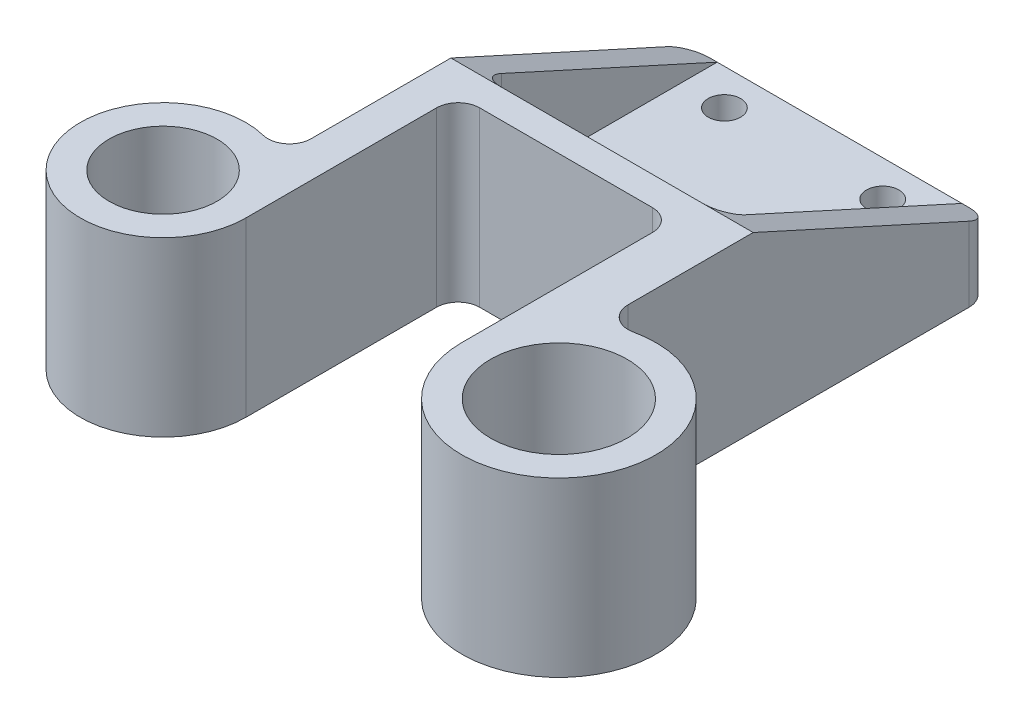
ISO-10303-21;
HEADER;
FILE_DESCRIPTION(('STEP AP214'),'2;1');
FILE_NAME('part.step','',(''),(''),'','','');
FILE_SCHEMA(('AUTOMOTIVE_DESIGN { 1 0 10303 214 1 1 1 1 }'));
ENDSEC;
DATA;
#1=APPLICATION_CONTEXT('core data for automotive mechanical design processes');
#2=APPLICATION_PROTOCOL_DEFINITION('international standard','automotive_design',2000,#1);
#3=PRODUCT_CONTEXT('',#1,'mechanical');
#4=PRODUCT('Part','Part','',(#3));
#5=PRODUCT_RELATED_PRODUCT_CATEGORY('part','',(#4));
#6=PRODUCT_DEFINITION_FORMATION('','',#4);
#7=PRODUCT_DEFINITION_CONTEXT('part definition',#1,'design');
#8=PRODUCT_DEFINITION('design','',#6,#7);
#9=PRODUCT_DEFINITION_SHAPE('','',#8);
#10=(LENGTH_UNIT() NAMED_UNIT(*) SI_UNIT(.MILLI.,.METRE.));
#11=(NAMED_UNIT(*) PLANE_ANGLE_UNIT() SI_UNIT($,.RADIAN.));
#12=(NAMED_UNIT(*) SI_UNIT($,.STERADIAN.) SOLID_ANGLE_UNIT());
#13=UNCERTAINTY_MEASURE_WITH_UNIT(LENGTH_MEASURE(1.E-05),#10,'distance_accuracy_value','');
#14=(GEOMETRIC_REPRESENTATION_CONTEXT(3) GLOBAL_UNCERTAINTY_ASSIGNED_CONTEXT((#13)) GLOBAL_UNIT_ASSIGNED_CONTEXT((#10,
#11,#12)) REPRESENTATION_CONTEXT('',''));
#15=CARTESIAN_POINT('',(0.,0.,0.));
#16=DIRECTION('',(0.,0.,1.));
#17=DIRECTION('',(1.,0.,0.));
#18=AXIS2_PLACEMENT_3D('',#15,#16,#17);
#19=CARTESIAN_POINT('',(11.,24.,-38.5));
#20=DIRECTION('',(0.,-1.,0.));
#21=DIRECTION('',(0.,0.,-1.));
#22=AXIS2_PLACEMENT_3D('',#19,#20,#21);
#23=CYLINDRICAL_SURFACE('',#22,2.25);
#24=CARTESIAN_POINT('',(11.,0.,-38.5));
#25=DIRECTION('',(0.,1.,0.));
#26=DIRECTION('',(0.,0.,1.));
#27=AXIS2_PLACEMENT_3D('',#24,#25,#26);
#28=CIRCLE('',#27,2.25);
#29=CARTESIAN_POINT('',(11.,0.,-36.25));
#30=VERTEX_POINT('',#29);
#31=EDGE_CURVE('E285',#30,#30,#28,.T.);
#32=ORIENTED_EDGE('',*,*,#31,.F.);
#33=EDGE_LOOP('',(#32));
#34=FACE_BOUND('',#33,.T.);
#35=CARTESIAN_POINT('',(11.,9.,-38.5));
#36=DIRECTION('',(0.,1.,0.));
#37=DIRECTION('',(0.,0.,1.));
#38=AXIS2_PLACEMENT_3D('',#35,#36,#37);
#39=CIRCLE('',#38,2.25);
#40=CARTESIAN_POINT('',(11.,9.,-36.25));
#41=VERTEX_POINT('',#40);
#42=EDGE_CURVE('E220',#41,#41,#39,.T.);
#43=ORIENTED_EDGE('',*,*,#42,.T.);
#44=EDGE_LOOP('',(#43));
#45=FACE_BOUND('',#44,.T.);
#46=ADVANCED_FACE('F35',(#34,#45),#23,.F.);
#47=CARTESIAN_POINT('',(-11.,24.,-38.5));
#48=DIRECTION('',(0.,-1.,0.));
#49=DIRECTION('',(0.,0.,-1.));
#50=AXIS2_PLACEMENT_3D('',#47,#48,#49);
#51=CYLINDRICAL_SURFACE('',#50,2.25);
#52=CARTESIAN_POINT('',(-11.,0.,-38.5));
#53=DIRECTION('',(0.,1.,0.));
#54=DIRECTION('',(0.,0.,1.));
#55=AXIS2_PLACEMENT_3D('',#52,#53,#54);
#56=CIRCLE('',#55,2.25);
#57=CARTESIAN_POINT('',(-11.,0.,-36.25));
#58=VERTEX_POINT('',#57);
#59=EDGE_CURVE('E256',#58,#58,#56,.T.);
#60=ORIENTED_EDGE('',*,*,#59,.F.);
#61=EDGE_LOOP('',(#60));
#62=FACE_BOUND('',#61,.T.);
#63=CARTESIAN_POINT('',(-11.,9.,-38.5));
#64=DIRECTION('',(0.,1.,0.));
#65=DIRECTION('',(0.,0.,1.));
#66=AXIS2_PLACEMENT_3D('',#63,#64,#65);
#67=CIRCLE('',#66,2.25);
#68=CARTESIAN_POINT('',(-11.,9.,-36.25));
#69=VERTEX_POINT('',#68);
#70=EDGE_CURVE('E217',#69,#69,#67,.T.);
#71=ORIENTED_EDGE('',*,*,#70,.T.);
#72=EDGE_LOOP('',(#71));
#73=FACE_BOUND('',#72,.T.);
#74=ADVANCED_FACE('F412',(#62,#73),#51,.F.);
#75=CARTESIAN_POINT('',(11.,24.,-61.5));
#76=DIRECTION('',(0.,-1.,0.));
#77=DIRECTION('',(0.,0.,-1.));
#78=AXIS2_PLACEMENT_3D('',#75,#76,#77);
#79=CYLINDRICAL_SURFACE('',#78,2.25);
#80=CARTESIAN_POINT('',(11.,0.,-61.5));
#81=DIRECTION('',(0.,1.,0.));
#82=DIRECTION('',(0.,0.,1.));
#83=AXIS2_PLACEMENT_3D('',#80,#81,#82);
#84=CIRCLE('',#83,2.25);
#85=CARTESIAN_POINT('',(11.,0.,-59.25));
#86=VERTEX_POINT('',#85);
#87=EDGE_CURVE('E253',#86,#86,#84,.T.);
#88=ORIENTED_EDGE('',*,*,#87,.F.);
#89=EDGE_LOOP('',(#88));
#90=FACE_BOUND('',#89,.T.);
#91=CARTESIAN_POINT('',(11.,9.,-61.5));
#92=DIRECTION('',(0.,1.,0.));
#93=DIRECTION('',(0.,0.,1.));
#94=AXIS2_PLACEMENT_3D('',#91,#92,#93);
#95=CIRCLE('',#94,2.25);
#96=CARTESIAN_POINT('',(11.,9.,-59.25));
#97=VERTEX_POINT('',#96);
#98=EDGE_CURVE('E208',#97,#97,#95,.T.);
#99=ORIENTED_EDGE('',*,*,#98,.T.);
#100=EDGE_LOOP('',(#99));
#101=FACE_BOUND('',#100,.T.);
#102=ADVANCED_FACE('F418',(#90,#101),#79,.F.);
#103=CARTESIAN_POINT('',(-11.,24.,-61.5));
#104=DIRECTION('',(0.,-1.,0.));
#105=DIRECTION('',(0.,0.,-1.));
#106=AXIS2_PLACEMENT_3D('',#103,#104,#105);
#107=CYLINDRICAL_SURFACE('',#106,2.25);
#108=CARTESIAN_POINT('',(-11.,0.,-61.5));
#109=DIRECTION('',(0.,1.,0.));
#110=DIRECTION('',(0.,0.,1.));
#111=AXIS2_PLACEMENT_3D('',#108,#109,#110);
#112=CIRCLE('',#111,2.25);
#113=CARTESIAN_POINT('',(-11.,0.,-59.25));
#114=VERTEX_POINT('',#113);
#115=EDGE_CURVE('E223',#114,#114,#112,.T.);
#116=ORIENTED_EDGE('',*,*,#115,.F.);
#117=EDGE_LOOP('',(#116));
#118=FACE_BOUND('',#117,.T.);
#119=CARTESIAN_POINT('',(-11.,9.,-61.5));
#120=DIRECTION('',(0.,1.,0.));
#121=DIRECTION('',(0.,0.,1.));
#122=AXIS2_PLACEMENT_3D('',#119,#120,#121);
#123=CIRCLE('',#122,2.25);
#124=CARTESIAN_POINT('',(-11.,9.,-59.25));
#125=VERTEX_POINT('',#124);
#126=EDGE_CURVE('E205',#125,#125,#123,.T.);
#127=ORIENTED_EDGE('',*,*,#126,.T.);
#128=EDGE_LOOP('',(#127));
#129=FACE_BOUND('',#128,.T.);
#130=ADVANCED_FACE('F453',(#118,#129),#107,.F.);
#131=CARTESIAN_POINT('',(27.5,24.,0.));
#132=DIRECTION('',(0.,-1.,0.));
#133=DIRECTION('',(0.,0.,-1.));
#134=AXIS2_PLACEMENT_3D('',#131,#132,#133);
#135=CYLINDRICAL_SURFACE('',#134,13.5);
#136=CARTESIAN_POINT('',(27.5,0.,0.));
#137=DIRECTION('',(0.,1.,0.));
#138=DIRECTION('',(0.,0.,1.));
#139=AXIS2_PLACEMENT_3D('',#136,#137,#138);
#140=CIRCLE('',#139,13.5);
#141=CARTESIAN_POINT('',(14.,0.,0.));
#142=VERTEX_POINT('',#141);
#143=CARTESIAN_POINT('',(24.6363636363636,0.,-13.1927854063067));
#144=VERTEX_POINT('',#143);
#145=EDGE_CURVE('E262',#142,#144,#140,.T.);
#146=ORIENTED_EDGE('',*,*,#145,.T.);
#147=DIRECTION('',(0.,-1.,0.));
#148=VECTOR('',#147,1.);
#149=CARTESIAN_POINT('',(24.6363636363636,24.,-13.1927854063067));
#150=LINE('',#149,#148);
#151=CARTESIAN_POINT('',(24.6363636363636,24.,-13.1927854063067));
#152=VERTEX_POINT('',#151);
#153=EDGE_CURVE('E327',#144,#152,#150,.F.);
#154=ORIENTED_EDGE('',*,*,#153,.T.);
#155=CARTESIAN_POINT('',(27.5,24.,0.));
#156=DIRECTION('',(0.,1.,0.));
#157=DIRECTION('',(0.,0.,1.));
#158=AXIS2_PLACEMENT_3D('',#155,#156,#157);
#159=CIRCLE('',#158,13.5);
#160=CARTESIAN_POINT('',(14.,24.,0.));
#161=VERTEX_POINT('',#160);
#162=EDGE_CURVE('E227',#161,#152,#159,.T.);
#163=ORIENTED_EDGE('',*,*,#162,.F.);
#164=DIRECTION('',(0.,-1.,0.));
#165=VECTOR('',#164,1.);
#166=CARTESIAN_POINT('',(14.,24.,0.));
#167=LINE('',#166,#165);
#168=EDGE_CURVE('E250',#161,#142,#167,.T.);
#169=ORIENTED_EDGE('',*,*,#168,.T.);
#170=EDGE_LOOP('',(#146,#154,#163,#169));
#171=FACE_BOUND('',#170,.T.);
#172=ADVANCED_FACE('F449',(#171),#135,.T.);
#173=CARTESIAN_POINT('',(21.,24.,0.));
#174=DIRECTION('',(1.,0.,0.));
#175=DIRECTION('',(0.,0.,-1.));
#176=AXIS2_PLACEMENT_3D('',#173,#174,#175);
#177=PLANE('',#176);
#178=DIRECTION('',(0.,0.,1.));
#179=VECTOR('',#178,1.);
#180=CARTESIAN_POINT('',(21.,24.,0.));
#181=LINE('',#180,#179);
#182=CARTESIAN_POINT('',(21.,24.,-33.5));
#183=VERTEX_POINT('',#182);
#184=CARTESIAN_POINT('',(21.,24.,-16.1245154965971));
#185=VERTEX_POINT('',#184);
#186=EDGE_CURVE('E231',#183,#185,#181,.T.);
#187=ORIENTED_EDGE('',*,*,#186,.T.);
#188=DIRECTION('',(0.,-1.,0.));
#189=VECTOR('',#188,1.);
#190=CARTESIAN_POINT('',(21.,24.,-16.1245154965971));
#191=LINE('',#190,#189);
#192=CARTESIAN_POINT('',(21.,0.,-16.1245154965971));
#193=VERTEX_POINT('',#192);
#194=EDGE_CURVE('E324',#185,#193,#191,.T.);
#195=ORIENTED_EDGE('',*,*,#194,.T.);
#196=DIRECTION('',(0.,0.,1.));
#197=VECTOR('',#196,1.);
#198=CARTESIAN_POINT('',(21.,0.,0.));
#199=LINE('',#198,#197);
#200=CARTESIAN_POINT('',(21.,0.,-63.5));
#201=VERTEX_POINT('',#200);
#202=EDGE_CURVE('E265',#201,#193,#199,.T.);
#203=ORIENTED_EDGE('',*,*,#202,.F.);
#204=DIRECTION('',(0.,-1.,0.));
#205=VECTOR('',#204,1.);
#206=CARTESIAN_POINT('',(21.,24.,-63.5));
#207=LINE('',#206,#205);
#208=CARTESIAN_POINT('',(21.,10.3636363636364,-63.5));
#209=VERTEX_POINT('',#208);
#210=EDGE_CURVE('E322',#201,#209,#207,.F.);
#211=ORIENTED_EDGE('',*,*,#210,.T.);
#212=DIRECTION('',(0.,-0.413802944301184,-0.910366477462605));
#213=VECTOR('',#212,1.);
#214=CARTESIAN_POINT('',(21.,36.6198630136986,-5.73630136986302));
#215=LINE('',#214,#213);
#216=EDGE_CURVE('E214',#183,#209,#215,.T.);
#217=ORIENTED_EDGE('',*,*,#216,.F.);
#218=EDGE_LOOP('',(#187,#195,#203,#211,#217));
#219=FACE_BOUND('',#218,.T.);
#220=ADVANCED_FACE('F446',(#219),#177,.T.);
#221=CARTESIAN_POINT('',(0.,24.,-66.5));
#222=DIRECTION('',(0.,0.,-1.));
#223=DIRECTION('',(-1.,0.,0.));
#224=AXIS2_PLACEMENT_3D('',#221,#222,#223);
#225=PLANE('',#224);
#226=DIRECTION('',(1.,0.,0.));
#227=VECTOR('',#226,1.);
#228=CARTESIAN_POINT('',(0.,0.,-66.5));
#229=LINE('',#228,#227);
#230=CARTESIAN_POINT('',(-18.,0.,-66.5));
#231=VERTEX_POINT('',#230);
#232=CARTESIAN_POINT('',(18.,0.,-66.5));
#233=VERTEX_POINT('',#232);
#234=EDGE_CURVE('E268',#231,#233,#229,.T.);
#235=ORIENTED_EDGE('',*,*,#234,.F.);
#236=DIRECTION('',(0.,-1.,0.));
#237=VECTOR('',#236,1.);
#238=CARTESIAN_POINT('',(-18.,24.,-66.5));
#239=LINE('',#238,#237);
#240=CARTESIAN_POINT('',(-18.,9.,-66.5));
#241=VERTEX_POINT('',#240);
#242=EDGE_CURVE('E175',#231,#241,#239,.F.);
#243=ORIENTED_EDGE('',*,*,#242,.T.);
#244=DIRECTION('',(1.,0.,0.));
#245=VECTOR('',#244,1.);
#246=CARTESIAN_POINT('',(-39.,9.,-66.5));
#247=LINE('',#246,#245);
#248=CARTESIAN_POINT('',(-17.,9.,-66.5));
#249=VERTEX_POINT('',#248);
#250=EDGE_CURVE('E167',#241,#249,#247,.T.);
#251=ORIENTED_EDGE('',*,*,#250,.T.);
#252=DIRECTION('',(-1.,0.,0.));
#253=VECTOR('',#252,1.);
#254=CARTESIAN_POINT('',(-17.,9.,-66.5));
#255=LINE('',#254,#253);
#256=CARTESIAN_POINT('',(17.,9.,-66.5));
#257=VERTEX_POINT('',#256);
#258=EDGE_CURVE('E173',#257,#249,#255,.T.);
#259=ORIENTED_EDGE('',*,*,#258,.F.);
#260=CARTESIAN_POINT('',(18.,9.,-66.5));
#261=VERTEX_POINT('',#260);
#262=EDGE_CURVE('E179',#257,#261,#247,.T.);
#263=ORIENTED_EDGE('',*,*,#262,.T.);
#264=DIRECTION('',(0.,-1.,0.));
#265=VECTOR('',#264,1.);
#266=CARTESIAN_POINT('',(18.,24.,-66.5));
#267=LINE('',#266,#265);
#268=EDGE_CURVE('E306',#261,#233,#267,.T.);
#269=ORIENTED_EDGE('',*,*,#268,.T.);
#270=EDGE_LOOP('',(#235,#243,#251,#259,#263,#269));
#271=FACE_BOUND('',#270,.T.);
#272=ADVANCED_FACE('F170',(#271),#225,.T.);
#273=CARTESIAN_POINT('',(-21.,24.,0.));
#274=DIRECTION('',(-1.,0.,0.));
#275=DIRECTION('',(0.,0.,1.));
#276=AXIS2_PLACEMENT_3D('',#273,#274,#275);
#277=PLANE('',#276);
#278=DIRECTION('',(0.,0.,-1.));
#279=VECTOR('',#278,1.);
#280=CARTESIAN_POINT('',(-21.,0.,0.));
#281=LINE('',#280,#279);
#282=CARTESIAN_POINT('',(-21.,0.,-14.0712472794703));
#283=VERTEX_POINT('',#282);
#284=CARTESIAN_POINT('',(-21.,0.,-63.5));
#285=VERTEX_POINT('',#284);
#286=EDGE_CURVE('E271',#283,#285,#281,.T.);
#287=ORIENTED_EDGE('',*,*,#286,.F.);
#288=DIRECTION('',(0.,-1.,0.));
#289=VECTOR('',#288,1.);
#290=CARTESIAN_POINT('',(-21.,24.,-14.0712472794703));
#291=LINE('',#290,#289);
#292=CARTESIAN_POINT('',(-21.,24.,-14.0712472794703));
#293=VERTEX_POINT('',#292);
#294=EDGE_CURVE('E300',#283,#293,#291,.F.);
#295=ORIENTED_EDGE('',*,*,#294,.T.);
#296=DIRECTION('',(0.,0.,-1.));
#297=VECTOR('',#296,1.);
#298=CARTESIAN_POINT('',(-21.,24.,0.));
#299=LINE('',#298,#297);
#300=CARTESIAN_POINT('',(-21.,24.,-33.5));
#301=VERTEX_POINT('',#300);
#302=EDGE_CURVE('E234',#293,#301,#299,.T.);
#303=ORIENTED_EDGE('',*,*,#302,.T.);
#304=DIRECTION('',(0.,0.413802944301184,0.910366477462605));
#305=VECTOR('',#304,1.);
#306=CARTESIAN_POINT('',(-21.,36.6198630136986,-5.73630136986302));
#307=LINE('',#306,#305);
#308=CARTESIAN_POINT('',(-21.,10.3636363636364,-63.5));
#309=VERTEX_POINT('',#308);
#310=EDGE_CURVE('E189',#309,#301,#307,.T.);
#311=ORIENTED_EDGE('',*,*,#310,.F.);
#312=DIRECTION('',(0.,-1.,0.));
#313=VECTOR('',#312,1.);
#314=CARTESIAN_POINT('',(-21.,24.,-63.5));
#315=LINE('',#314,#313);
#316=EDGE_CURVE('E297',#309,#285,#315,.T.);
#317=ORIENTED_EDGE('',*,*,#316,.T.);
#318=EDGE_LOOP('',(#287,#295,#303,#311,#317));
#319=FACE_BOUND('',#318,.T.);
#320=ADVANCED_FACE('F439',(#319),#277,.T.);
#321=CARTESIAN_POINT('',(-27.5,24.,0.));
#322=DIRECTION('',(0.,-1.,0.));
#323=DIRECTION('',(0.,0.,-1.));
#324=AXIS2_PLACEMENT_3D('',#321,#322,#323);
#325=CYLINDRICAL_SURFACE('',#324,11.5);
#326=CARTESIAN_POINT('',(-27.5,24.,0.));
#327=DIRECTION('',(0.,1.,0.));
#328=DIRECTION('',(0.,0.,1.));
#329=AXIS2_PLACEMENT_3D('',#326,#327,#328);
#330=CIRCLE('',#329,11.5);
#331=CARTESIAN_POINT('',(-24.7241379310345,24.,-11.1599547388902));
#332=VERTEX_POINT('',#331);
#333=CARTESIAN_POINT('',(-16.,24.,0.));
#334=VERTEX_POINT('',#333);
#335=EDGE_CURVE('E236',#332,#334,#330,.T.);
#336=ORIENTED_EDGE('',*,*,#335,.F.);
#337=DIRECTION('',(0.,-1.,0.));
#338=VECTOR('',#337,1.);
#339=CARTESIAN_POINT('',(-24.7241379310345,24.,-11.1599547388902));
#340=LINE('',#339,#338);
#341=CARTESIAN_POINT('',(-24.7241379310345,0.,-11.1599547388902));
#342=VERTEX_POINT('',#341);
#343=EDGE_CURVE('E293',#332,#342,#340,.T.);
#344=ORIENTED_EDGE('',*,*,#343,.T.);
#345=CARTESIAN_POINT('',(-27.5,0.,0.));
#346=DIRECTION('',(0.,1.,0.));
#347=DIRECTION('',(0.,0.,1.));
#348=AXIS2_PLACEMENT_3D('',#345,#346,#347);
#349=CIRCLE('',#348,11.5);
#350=CARTESIAN_POINT('',(-16.,0.,0.));
#351=VERTEX_POINT('',#350);
#352=EDGE_CURVE('E274',#342,#351,#349,.T.);
#353=ORIENTED_EDGE('',*,*,#352,.T.);
#354=DIRECTION('',(0.,-1.,0.));
#355=VECTOR('',#354,1.);
#356=CARTESIAN_POINT('',(-16.,24.,0.));
#357=LINE('',#356,#355);
#358=EDGE_CURVE('E291',#334,#351,#357,.T.);
#359=ORIENTED_EDGE('',*,*,#358,.F.);
#360=EDGE_LOOP('',(#336,#344,#353,#359));
#361=FACE_BOUND('',#360,.T.);
#362=ADVANCED_FACE('F435',(#361),#325,.T.);
#363=CARTESIAN_POINT('',(-16.,24.,0.));
#364=DIRECTION('',(-1.,0.,0.));
#365=DIRECTION('',(0.,0.,1.));
#366=AXIS2_PLACEMENT_3D('',#363,#364,#365);
#367=PLANE('',#366);
#368=DIRECTION('',(0.,0.,-1.));
#369=VECTOR('',#368,1.);
#370=CARTESIAN_POINT('',(-16.,0.,0.));
#371=LINE('',#370,#369);
#372=CARTESIAN_POINT('',(-16.,0.,-26.5));
#373=VERTEX_POINT('',#372);
#374=EDGE_CURVE('E276',#351,#373,#371,.T.);
#375=ORIENTED_EDGE('',*,*,#374,.T.);
#376=DIRECTION('',(0.,-1.,0.));
#377=VECTOR('',#376,1.);
#378=CARTESIAN_POINT('',(-16.,24.,-26.5));
#379=LINE('',#378,#377);
#380=CARTESIAN_POINT('',(-16.,24.,-26.5));
#381=VERTEX_POINT('',#380);
#382=EDGE_CURVE('E317',#373,#381,#379,.F.);
#383=ORIENTED_EDGE('',*,*,#382,.T.);
#384=DIRECTION('',(0.,0.,-1.));
#385=VECTOR('',#384,1.);
#386=CARTESIAN_POINT('',(-16.,24.,0.));
#387=LINE('',#386,#385);
#388=EDGE_CURVE('E238',#334,#381,#387,.T.);
#389=ORIENTED_EDGE('',*,*,#388,.F.);
#390=ORIENTED_EDGE('',*,*,#358,.T.);
#391=EDGE_LOOP('',(#375,#383,#389,#390));
#392=FACE_BOUND('',#391,.T.);
#393=ADVANCED_FACE('F431',(#392),#367,.F.);
#394=CARTESIAN_POINT('',(0.,24.,-29.5));
#395=DIRECTION('',(0.,0.,-1.));
#396=DIRECTION('',(-1.,0.,0.));
#397=AXIS2_PLACEMENT_3D('',#394,#395,#396);
#398=PLANE('',#397);
#399=DIRECTION('',(1.,0.,0.));
#400=VECTOR('',#399,1.);
#401=CARTESIAN_POINT('',(0.,24.,-29.5));
#402=LINE('',#401,#400);
#403=CARTESIAN_POINT('',(-13.,24.,-29.5));
#404=VERTEX_POINT('',#403);
#405=CARTESIAN_POINT('',(11.,24.,-29.5));
#406=VERTEX_POINT('',#405);
#407=EDGE_CURVE('E241',#404,#406,#402,.T.);
#408=ORIENTED_EDGE('',*,*,#407,.F.);
#409=DIRECTION('',(0.,-1.,0.));
#410=VECTOR('',#409,1.);
#411=CARTESIAN_POINT('',(-13.,0.,-29.5));
#412=LINE('',#411,#410);
#413=CARTESIAN_POINT('',(-13.,0.,-29.5));
#414=VERTEX_POINT('',#413);
#415=EDGE_CURVE('E314',#404,#414,#412,.T.);
#416=ORIENTED_EDGE('',*,*,#415,.T.);
#417=DIRECTION('',(1.,0.,0.));
#418=VECTOR('',#417,1.);
#419=CARTESIAN_POINT('',(0.,0.,-29.5));
#420=LINE('',#419,#418);
#421=CARTESIAN_POINT('',(11.,0.,-29.5));
#422=VERTEX_POINT('',#421);
#423=EDGE_CURVE('E279',#414,#422,#420,.T.);
#424=ORIENTED_EDGE('',*,*,#423,.T.);
#425=DIRECTION('',(0.,-1.,0.));
#426=VECTOR('',#425,1.);
#427=CARTESIAN_POINT('',(11.,24.,-29.5));
#428=LINE('',#427,#426);
#429=EDGE_CURVE('E312',#422,#406,#428,.F.);
#430=ORIENTED_EDGE('',*,*,#429,.T.);
#431=EDGE_LOOP('',(#408,#416,#424,#430));
#432=FACE_BOUND('',#431,.T.);
#433=ADVANCED_FACE('F427',(#432),#398,.F.);
#434=CARTESIAN_POINT('',(14.,24.,0.));
#435=DIRECTION('',(-1.,0.,0.));
#436=DIRECTION('',(0.,0.,1.));
#437=AXIS2_PLACEMENT_3D('',#434,#435,#436);
#438=PLANE('',#437);
#439=DIRECTION('',(0.,0.,-1.));
#440=VECTOR('',#439,1.);
#441=CARTESIAN_POINT('',(14.,24.,0.));
#442=LINE('',#441,#440);
#443=CARTESIAN_POINT('',(14.,24.,-26.5));
#444=VERTEX_POINT('',#443);
#445=EDGE_CURVE('E244',#161,#444,#442,.T.);
#446=ORIENTED_EDGE('',*,*,#445,.T.);
#447=DIRECTION('',(0.,-1.,0.));
#448=VECTOR('',#447,1.);
#449=CARTESIAN_POINT('',(14.,24.,-26.5));
#450=LINE('',#449,#448);
#451=CARTESIAN_POINT('',(14.,0.,-26.5));
#452=VERTEX_POINT('',#451);
#453=EDGE_CURVE('E319',#444,#452,#450,.T.);
#454=ORIENTED_EDGE('',*,*,#453,.T.);
#455=DIRECTION('',(0.,0.,-1.));
#456=VECTOR('',#455,1.);
#457=CARTESIAN_POINT('',(14.,0.,0.));
#458=LINE('',#457,#456);
#459=EDGE_CURVE('E282',#142,#452,#458,.T.);
#460=ORIENTED_EDGE('',*,*,#459,.F.);
#461=ORIENTED_EDGE('',*,*,#168,.F.);
#462=EDGE_LOOP('',(#446,#454,#460,#461));
#463=FACE_BOUND('',#462,.T.);
#464=ADVANCED_FACE('F424',(#463),#438,.T.);
#465=CARTESIAN_POINT('',(27.5,24.,0.));
#466=DIRECTION('',(0.,-1.,0.));
#467=DIRECTION('',(0.,0.,-1.));
#468=AXIS2_PLACEMENT_3D('',#465,#466,#467);
#469=CYLINDRICAL_SURFACE('',#468,9.50000000000001);
#470=CARTESIAN_POINT('',(27.5,24.,0.));
#471=DIRECTION('',(0.,1.,0.));
#472=DIRECTION('',(0.,0.,1.));
#473=AXIS2_PLACEMENT_3D('',#470,#471,#472);
#474=CIRCLE('',#473,9.50000000000001);
#475=CARTESIAN_POINT('',(27.5,24.,9.50000000000001));
#476=VERTEX_POINT('',#475);
#477=EDGE_CURVE('E224',#476,#476,#474,.T.);
#478=ORIENTED_EDGE('',*,*,#477,.T.);
#479=EDGE_LOOP('',(#478));
#480=FACE_BOUND('',#479,.T.);
#481=CARTESIAN_POINT('',(27.5,0.,0.));
#482=DIRECTION('',(0.,1.,0.));
#483=DIRECTION('',(0.,0.,1.));
#484=AXIS2_PLACEMENT_3D('',#481,#482,#483);
#485=CIRCLE('',#484,9.50000000000001);
#486=CARTESIAN_POINT('',(27.5,0.,9.50000000000001));
#487=VERTEX_POINT('',#486);
#488=EDGE_CURVE('E259',#487,#487,#485,.T.);
#489=ORIENTED_EDGE('',*,*,#488,.F.);
#490=EDGE_LOOP('',(#489));
#491=FACE_BOUND('',#490,.T.);
#492=ADVANCED_FACE('F398',(#480,#491),#469,.F.);
#493=CARTESIAN_POINT('',(-27.5,24.,0.));
#494=DIRECTION('',(0.,-1.,0.));
#495=DIRECTION('',(0.,0.,-1.));
#496=AXIS2_PLACEMENT_3D('',#493,#494,#495);
#497=CYLINDRICAL_SURFACE('',#496,7.5);
#498=CARTESIAN_POINT('',(-27.5,24.,0.));
#499=DIRECTION('',(0.,1.,0.));
#500=DIRECTION('',(0.,0.,1.));
#501=AXIS2_PLACEMENT_3D('',#498,#499,#500);
#502=CIRCLE('',#501,7.5);
#503=CARTESIAN_POINT('',(-27.5,24.,7.5));
#504=VERTEX_POINT('',#503);
#505=EDGE_CURVE('E247',#504,#504,#502,.T.);
#506=ORIENTED_EDGE('',*,*,#505,.T.);
#507=EDGE_LOOP('',(#506));
#508=FACE_BOUND('',#507,.T.);
#509=CARTESIAN_POINT('',(-27.5,0.,0.));
#510=DIRECTION('',(0.,1.,0.));
#511=DIRECTION('',(0.,0.,1.));
#512=AXIS2_PLACEMENT_3D('',#509,#510,#511);
#513=CIRCLE('',#512,7.5);
#514=CARTESIAN_POINT('',(-27.5,0.,7.5));
#515=VERTEX_POINT('',#514);
#516=EDGE_CURVE('E228',#515,#515,#513,.T.);
#517=ORIENTED_EDGE('',*,*,#516,.F.);
#518=EDGE_LOOP('',(#517));
#519=FACE_BOUND('',#518,.T.);
#520=ADVANCED_FACE('F390',(#508,#519),#497,.F.);
#521=CARTESIAN_POINT('',(0.,24.,0.));
#522=DIRECTION('',(0.,1.,0.));
#523=DIRECTION('',(0.,0.,1.));
#524=AXIS2_PLACEMENT_3D('',#521,#522,#523);
#525=PLANE('',#524);
#526=DIRECTION('',(1.,0.,0.));
#527=VECTOR('',#526,1.);
#528=CARTESIAN_POINT('',(-39.,24.,-33.5));
#529=LINE('',#528,#527);
#530=CARTESIAN_POINT('',(-14.,24.,-33.5));
#531=VERTEX_POINT('',#530);
#532=EDGE_CURVE('E380',#301,#531,#529,.T.);
#533=ORIENTED_EDGE('',*,*,#532,.F.);
#534=ORIENTED_EDGE('',*,*,#302,.F.);
#535=CARTESIAN_POINT('',(-24.,24.,-14.0712472794703));
#536=DIRECTION('',(0.,1.,0.));
#537=DIRECTION('',(0.,0.,1.));
#538=AXIS2_PLACEMENT_3D('',#535,#536,#537);
#539=CIRCLE('',#538,3.);
#540=EDGE_CURVE('E346',#293,#332,#539,.F.);
#541=ORIENTED_EDGE('',*,*,#540,.T.);
#542=ORIENTED_EDGE('',*,*,#335,.T.);
#543=ORIENTED_EDGE('',*,*,#388,.T.);
#544=CARTESIAN_POINT('',(-13.,24.,-26.5));
#545=DIRECTION('',(0.,1.,0.));
#546=DIRECTION('',(0.,0.,1.));
#547=AXIS2_PLACEMENT_3D('',#544,#545,#546);
#548=CIRCLE('',#547,3.);
#549=EDGE_CURVE('E350',#381,#404,#548,.F.);
#550=ORIENTED_EDGE('',*,*,#549,.T.);
#551=ORIENTED_EDGE('',*,*,#407,.T.);
#552=CARTESIAN_POINT('',(11.,24.,-26.5));
#553=DIRECTION('',(0.,1.,0.));
#554=DIRECTION('',(0.,0.,1.));
#555=AXIS2_PLACEMENT_3D('',#552,#553,#554);
#556=CIRCLE('',#555,3.);
#557=EDGE_CURVE('E354',#406,#444,#556,.F.);
#558=ORIENTED_EDGE('',*,*,#557,.T.);
#559=ORIENTED_EDGE('',*,*,#445,.F.);
#560=ORIENTED_EDGE('',*,*,#162,.T.);
#561=CARTESIAN_POINT('',(24.,24.,-16.1245154965971));
#562=DIRECTION('',(0.,1.,0.));
#563=DIRECTION('',(0.,0.,1.));
#564=AXIS2_PLACEMENT_3D('',#561,#562,#563);
#565=CIRCLE('',#564,3.);
#566=EDGE_CURVE('E358',#152,#185,#565,.F.);
#567=ORIENTED_EDGE('',*,*,#566,.T.);
#568=ORIENTED_EDGE('',*,*,#186,.F.);
#569=CARTESIAN_POINT('',(14.,24.,-33.5));
#570=VERTEX_POINT('',#569);
#571=EDGE_CURVE('E51',#570,#183,#529,.T.);
#572=ORIENTED_EDGE('',*,*,#571,.F.);
#573=DIRECTION('',(1.,0.,0.));
#574=VECTOR('',#573,1.);
#575=CARTESIAN_POINT('',(-17.,24.,-33.5));
#576=LINE('',#575,#574);
#577=EDGE_CURVE('E198',#531,#570,#576,.T.);
#578=ORIENTED_EDGE('',*,*,#577,.F.);
#579=EDGE_LOOP('',(#533,#534,#541,#542,#543,#550,#551,#558,#559,#560,#567,#568,#572,#578));
#580=FACE_BOUND('',#579,.T.);
#581=ORIENTED_EDGE('',*,*,#477,.F.);
#582=EDGE_LOOP('',(#581));
#583=FACE_BOUND('',#582,.T.);
#584=ORIENTED_EDGE('',*,*,#505,.F.);
#585=EDGE_LOOP('',(#584));
#586=FACE_BOUND('',#585,.T.);
#587=ADVANCED_FACE('F386',(#580,#583,#586),#525,.T.);
#588=CARTESIAN_POINT('',(0.,0.,0.));
#589=DIRECTION('',(0.,1.,0.));
#590=DIRECTION('',(0.,0.,1.));
#591=AXIS2_PLACEMENT_3D('',#588,#589,#590);
#592=PLANE('',#591);
#593=ORIENTED_EDGE('',*,*,#115,.T.);
#594=EDGE_LOOP('',(#593));
#595=FACE_BOUND('',#594,.T.);
#596=ORIENTED_EDGE('',*,*,#87,.T.);
#597=EDGE_LOOP('',(#596));
#598=FACE_BOUND('',#597,.T.);
#599=ORIENTED_EDGE('',*,*,#59,.T.);
#600=EDGE_LOOP('',(#599));
#601=FACE_BOUND('',#600,.T.);
#602=ORIENTED_EDGE('',*,*,#488,.T.);
#603=EDGE_LOOP('',(#602));
#604=FACE_BOUND('',#603,.T.);
#605=ORIENTED_EDGE('',*,*,#286,.T.);
#606=CARTESIAN_POINT('',(-18.,0.,-63.5));
#607=DIRECTION('',(0.,1.,0.));
#608=DIRECTION('',(0.,0.,1.));
#609=AXIS2_PLACEMENT_3D('',#606,#607,#608);
#610=CIRCLE('',#609,3.);
#611=EDGE_CURVE('E304',#285,#231,#610,.F.);
#612=ORIENTED_EDGE('',*,*,#611,.T.);
#613=ORIENTED_EDGE('',*,*,#234,.T.);
#614=CARTESIAN_POINT('',(18.,0.,-63.5));
#615=DIRECTION('',(0.,1.,0.));
#616=DIRECTION('',(0.,0.,1.));
#617=AXIS2_PLACEMENT_3D('',#614,#615,#616);
#618=CIRCLE('',#617,3.);
#619=EDGE_CURVE('E302',#233,#201,#618,.F.);
#620=ORIENTED_EDGE('',*,*,#619,.T.);
#621=ORIENTED_EDGE('',*,*,#202,.T.);
#622=CARTESIAN_POINT('',(24.,0.,-16.1245154965971));
#623=DIRECTION('',(0.,1.,0.));
#624=DIRECTION('',(0.,0.,1.));
#625=AXIS2_PLACEMENT_3D('',#622,#623,#624);
#626=CIRCLE('',#625,3.);
#627=EDGE_CURVE('E356',#193,#144,#626,.T.);
#628=ORIENTED_EDGE('',*,*,#627,.T.);
#629=ORIENTED_EDGE('',*,*,#145,.F.);
#630=ORIENTED_EDGE('',*,*,#459,.T.);
#631=CARTESIAN_POINT('',(11.,0.,-26.5));
#632=DIRECTION('',(0.,1.,0.));
#633=DIRECTION('',(0.,0.,1.));
#634=AXIS2_PLACEMENT_3D('',#631,#632,#633);
#635=CIRCLE('',#634,3.);
#636=EDGE_CURVE('E352',#452,#422,#635,.T.);
#637=ORIENTED_EDGE('',*,*,#636,.T.);
#638=ORIENTED_EDGE('',*,*,#423,.F.);
#639=CARTESIAN_POINT('',(-13.,0.,-26.5));
#640=DIRECTION('',(0.,1.,0.));
#641=DIRECTION('',(0.,0.,1.));
#642=AXIS2_PLACEMENT_3D('',#639,#640,#641);
#643=CIRCLE('',#642,3.);
#644=EDGE_CURVE('E348',#414,#373,#643,.T.);
#645=ORIENTED_EDGE('',*,*,#644,.T.);
#646=ORIENTED_EDGE('',*,*,#374,.F.);
#647=ORIENTED_EDGE('',*,*,#352,.F.);
#648=CARTESIAN_POINT('',(-24.,0.,-14.0712472794703));
#649=DIRECTION('',(0.,1.,0.));
#650=DIRECTION('',(0.,0.,1.));
#651=AXIS2_PLACEMENT_3D('',#648,#649,#650);
#652=CIRCLE('',#651,3.);
#653=EDGE_CURVE('E344',#342,#283,#652,.T.);
#654=ORIENTED_EDGE('',*,*,#653,.T.);
#655=EDGE_LOOP('',(#605,#612,#613,#620,#621,#628,#629,#630,#637,#638,#645,#646,#647,#654));
#656=FACE_BOUND('',#655,.T.);
#657=ORIENTED_EDGE('',*,*,#31,.T.);
#658=EDGE_LOOP('',(#657));
#659=FACE_BOUND('',#658,.T.);
#660=ORIENTED_EDGE('',*,*,#516,.T.);
#661=EDGE_LOOP('',(#660));
#662=FACE_BOUND('',#661,.T.);
#663=ADVANCED_FACE('F389',(#595,#598,#601,#604,#656,#659,#662),#592,.F.);
#664=CARTESIAN_POINT('',(-17.,9.,-66.5));
#665=DIRECTION('',(-1.,0.,0.));
#666=DIRECTION('',(0.,0.,1.));
#667=AXIS2_PLACEMENT_3D('',#664,#665,#666);
#668=PLANE('',#667);
#669=DIRECTION('',(0.,0.413802944301184,0.910366477462605));
#670=VECTOR('',#669,1.);
#671=CARTESIAN_POINT('',(-17.,9.,-66.5));
#672=LINE('',#671,#670);
#673=CARTESIAN_POINT('',(-17.,22.6363636363636,-36.5));
#674=VERTEX_POINT('',#673);
#675=EDGE_CURVE('E182',#249,#674,#672,.T.);
#676=ORIENTED_EDGE('',*,*,#675,.T.);
#677=DIRECTION('',(0.,1.,0.));
#678=VECTOR('',#677,1.);
#679=CARTESIAN_POINT('',(-17.,9.,-36.5));
#680=LINE('',#679,#678);
#681=CARTESIAN_POINT('',(-17.,9.,-36.5));
#682=VERTEX_POINT('',#681);
#683=EDGE_CURVE('E194',#674,#682,#680,.F.);
#684=ORIENTED_EDGE('',*,*,#683,.T.);
#685=DIRECTION('',(0.,0.,1.));
#686=VECTOR('',#685,1.);
#687=CARTESIAN_POINT('',(-17.,9.,-66.5));
#688=LINE('',#687,#686);
#689=EDGE_CURVE('E192',#249,#682,#688,.T.);
#690=ORIENTED_EDGE('',*,*,#689,.F.);
#691=EDGE_LOOP('',(#676,#684,#690));
#692=FACE_BOUND('',#691,.T.);
#693=ADVANCED_FACE('F193',(#692),#668,.F.);
#694=CARTESIAN_POINT('',(17.,9.,-66.5));
#695=DIRECTION('',(1.,0.,0.));
#696=DIRECTION('',(0.,0.,-1.));
#697=AXIS2_PLACEMENT_3D('',#694,#695,#696);
#698=PLANE('',#697);
#699=DIRECTION('',(0.,0.,-1.));
#700=VECTOR('',#699,1.);
#701=CARTESIAN_POINT('',(17.,9.,-66.5));
#702=LINE('',#701,#700);
#703=CARTESIAN_POINT('',(17.,9.,-36.5));
#704=VERTEX_POINT('',#703);
#705=EDGE_CURVE('E203',#704,#257,#702,.T.);
#706=ORIENTED_EDGE('',*,*,#705,.F.);
#707=DIRECTION('',(0.,1.,0.));
#708=VECTOR('',#707,1.);
#709=CARTESIAN_POINT('',(17.,24.,-36.5));
#710=LINE('',#709,#708);
#711=CARTESIAN_POINT('',(17.,22.6363636363636,-36.5));
#712=VERTEX_POINT('',#711);
#713=EDGE_CURVE('E331',#704,#712,#710,.T.);
#714=ORIENTED_EDGE('',*,*,#713,.T.);
#715=DIRECTION('',(0.,-0.413802944301184,-0.910366477462605));
#716=VECTOR('',#715,1.);
#717=CARTESIAN_POINT('',(17.,9.,-66.5));
#718=LINE('',#717,#716);
#719=EDGE_CURVE('E178',#712,#257,#718,.T.);
#720=ORIENTED_EDGE('',*,*,#719,.T.);
#721=EDGE_LOOP('',(#706,#714,#720));
#722=FACE_BOUND('',#721,.T.);
#723=ADVANCED_FACE('F408',(#722),#698,.F.);
#724=CARTESIAN_POINT('',(-17.,9.,-33.5));
#725=DIRECTION('',(0.,0.,1.));
#726=DIRECTION('',(1.,0.,0.));
#727=AXIS2_PLACEMENT_3D('',#724,#725,#726);
#728=PLANE('',#727);
#729=ORIENTED_EDGE('',*,*,#577,.T.);
#730=DIRECTION('',(0.,1.,0.));
#731=VECTOR('',#730,1.);
#732=CARTESIAN_POINT('',(14.,9.,-33.5));
#733=LINE('',#732,#731);
#734=CARTESIAN_POINT('',(14.,9.,-33.5));
#735=VERTEX_POINT('',#734);
#736=EDGE_CURVE('E337',#570,#735,#733,.F.);
#737=ORIENTED_EDGE('',*,*,#736,.T.);
#738=DIRECTION('',(1.,0.,0.));
#739=VECTOR('',#738,1.);
#740=CARTESIAN_POINT('',(-17.,9.,-33.5));
#741=LINE('',#740,#739);
#742=CARTESIAN_POINT('',(-14.,9.,-33.5));
#743=VERTEX_POINT('',#742);
#744=EDGE_CURVE('E197',#743,#735,#741,.T.);
#745=ORIENTED_EDGE('',*,*,#744,.F.);
#746=DIRECTION('',(0.,1.,0.));
#747=VECTOR('',#746,1.);
#748=CARTESIAN_POINT('',(-14.,24.,-33.5));
#749=LINE('',#748,#747);
#750=EDGE_CURVE('E334',#743,#531,#749,.T.);
#751=ORIENTED_EDGE('',*,*,#750,.T.);
#752=EDGE_LOOP('',(#729,#737,#745,#751));
#753=FACE_BOUND('',#752,.T.);
#754=ADVANCED_FACE('F373',(#753),#728,.F.);
#755=CARTESIAN_POINT('',(0.,9.,0.));
#756=DIRECTION('',(0.,1.,0.));
#757=DIRECTION('',(0.,0.,1.));
#758=AXIS2_PLACEMENT_3D('',#755,#756,#757);
#759=PLANE('',#758);
#760=ORIENTED_EDGE('',*,*,#42,.F.);
#761=EDGE_LOOP('',(#760));
#762=FACE_BOUND('',#761,.T.);
#763=ORIENTED_EDGE('',*,*,#70,.F.);
#764=EDGE_LOOP('',(#763));
#765=FACE_BOUND('',#764,.T.);
#766=ORIENTED_EDGE('',*,*,#98,.F.);
#767=EDGE_LOOP('',(#766));
#768=FACE_BOUND('',#767,.T.);
#769=ORIENTED_EDGE('',*,*,#126,.F.);
#770=EDGE_LOOP('',(#769));
#771=FACE_BOUND('',#770,.T.);
#772=ORIENTED_EDGE('',*,*,#744,.T.);
#773=CARTESIAN_POINT('',(14.,9.,-36.5));
#774=DIRECTION('',(0.,1.,0.));
#775=DIRECTION('',(0.,0.,1.));
#776=AXIS2_PLACEMENT_3D('',#773,#774,#775);
#777=CIRCLE('',#776,3.);
#778=EDGE_CURVE('E341',#735,#704,#777,.T.);
#779=ORIENTED_EDGE('',*,*,#778,.T.);
#780=ORIENTED_EDGE('',*,*,#705,.T.);
#781=ORIENTED_EDGE('',*,*,#258,.T.);
#782=ORIENTED_EDGE('',*,*,#689,.T.);
#783=CARTESIAN_POINT('',(-14.,9.,-36.5));
#784=DIRECTION('',(0.,1.,0.));
#785=DIRECTION('',(0.,0.,1.));
#786=AXIS2_PLACEMENT_3D('',#783,#784,#785);
#787=CIRCLE('',#786,3.);
#788=EDGE_CURVE('E339',#682,#743,#787,.T.);
#789=ORIENTED_EDGE('',*,*,#788,.T.);
#790=EDGE_LOOP('',(#772,#779,#780,#781,#782,#789));
#791=FACE_BOUND('',#790,.T.);
#792=ADVANCED_FACE('F201',(#762,#765,#768,#771,#791),#759,.T.);
#793=CARTESIAN_POINT('',(-39.,24.,-33.5));
#794=DIRECTION('',(0.,-0.910366477462605,0.413802944301184));
#795=DIRECTION('',(0.,-0.413802944301184,-0.910366477462605));
#796=AXIS2_PLACEMENT_3D('',#793,#794,#795);
#797=PLANE('',#796);
#798=ORIENTED_EDGE('',*,*,#216,.T.);
#799=CARTESIAN_POINT('',(18.,10.3636363636364,-63.5));
#800=DIRECTION('',(0.,-0.910366477462605,0.413802944301184));
#801=DIRECTION('',(0.,-0.413802944301184,-0.910366477462605));
#802=AXIS2_PLACEMENT_3D('',#799,#800,#801);
#803=ELLIPSE('',#802,3.2953761746167,3.);
#804=EDGE_CURVE('E329',#209,#261,#803,.F.);
#805=ORIENTED_EDGE('',*,*,#804,.T.);
#806=ORIENTED_EDGE('',*,*,#262,.F.);
#807=ORIENTED_EDGE('',*,*,#719,.F.);
#808=CARTESIAN_POINT('',(14.,22.6363636363636,-36.5));
#809=DIRECTION('',(0.,-0.910366477462605,0.413802944301184));
#810=DIRECTION('',(0.,-0.413802944301184,-0.910366477462605));
#811=AXIS2_PLACEMENT_3D('',#808,#809,#810);
#812=ELLIPSE('',#811,3.2953761746167,3.);
#813=EDGE_CURVE('E44',#712,#570,#812,.T.);
#814=ORIENTED_EDGE('',*,*,#813,.T.);
#815=ORIENTED_EDGE('',*,*,#571,.T.);
#816=EDGE_LOOP('',(#798,#805,#806,#807,#814,#815));
#817=FACE_BOUND('',#816,.T.);
#818=ADVANCED_FACE('F364',(#817),#797,.F.);
#819=ORIENTED_EDGE('',*,*,#250,.F.);
#820=CARTESIAN_POINT('',(-18.,10.3636363636364,-63.5));
#821=DIRECTION('',(0.,-0.910366477462605,0.413802944301184));
#822=DIRECTION('',(0.,-0.413802944301184,-0.910366477462605));
#823=AXIS2_PLACEMENT_3D('',#820,#821,#822);
#824=ELLIPSE('',#823,3.2953761746167,3.);
#825=EDGE_CURVE('E310',#241,#309,#824,.F.);
#826=ORIENTED_EDGE('',*,*,#825,.T.);
#827=ORIENTED_EDGE('',*,*,#310,.T.);
#828=ORIENTED_EDGE('',*,*,#532,.T.);
#829=CARTESIAN_POINT('',(-14.,22.6363636363636,-36.5));
#830=DIRECTION('',(0.,-0.910366477462605,0.413802944301184));
#831=DIRECTION('',(0.,-0.413802944301184,-0.910366477462605));
#832=AXIS2_PLACEMENT_3D('',#829,#830,#831);
#833=ELLIPSE('',#832,3.2953761746167,3.);
#834=EDGE_CURVE('E11',#531,#674,#833,.T.);
#835=ORIENTED_EDGE('',*,*,#834,.T.);
#836=ORIENTED_EDGE('',*,*,#675,.F.);
#837=EDGE_LOOP('',(#819,#826,#827,#828,#835,#836));
#838=FACE_BOUND('',#837,.T.);
#839=ADVANCED_FACE('F184',(#838),#797,.F.);
#840=CARTESIAN_POINT('',(-24.,24.,-14.0712472794703));
#841=DIRECTION('',(0.,-1.,0.));
#842=DIRECTION('',(0.,0.,-1.));
#843=AXIS2_PLACEMENT_3D('',#840,#841,#842);
#844=CYLINDRICAL_SURFACE('',#843,3.);
#845=ORIENTED_EDGE('',*,*,#540,.F.);
#846=ORIENTED_EDGE('',*,*,#294,.F.);
#847=ORIENTED_EDGE('',*,*,#653,.F.);
#848=ORIENTED_EDGE('',*,*,#343,.F.);
#849=EDGE_LOOP('',(#845,#846,#847,#848));
#850=FACE_BOUND('',#849,.T.);
#851=ADVANCED_FACE('F464',(#850),#844,.F.);
#852=CARTESIAN_POINT('',(-18.,24.,-63.5));
#853=DIRECTION('',(0.,-1.,0.));
#854=DIRECTION('',(0.,0.,-1.));
#855=AXIS2_PLACEMENT_3D('',#852,#853,#854);
#856=CYLINDRICAL_SURFACE('',#855,3.);
#857=ORIENTED_EDGE('',*,*,#825,.F.);
#858=ORIENTED_EDGE('',*,*,#242,.F.);
#859=ORIENTED_EDGE('',*,*,#611,.F.);
#860=ORIENTED_EDGE('',*,*,#316,.F.);
#861=EDGE_LOOP('',(#857,#858,#859,#860));
#862=FACE_BOUND('',#861,.T.);
#863=ADVANCED_FACE('F467',(#862),#856,.T.);
#864=CARTESIAN_POINT('',(-13.,24.,-26.5));
#865=DIRECTION('',(0.,1.,0.));
#866=DIRECTION('',(0.,0.,1.));
#867=AXIS2_PLACEMENT_3D('',#864,#865,#866);
#868=CYLINDRICAL_SURFACE('',#867,3.);
#869=ORIENTED_EDGE('',*,*,#549,.F.);
#870=ORIENTED_EDGE('',*,*,#382,.F.);
#871=ORIENTED_EDGE('',*,*,#644,.F.);
#872=ORIENTED_EDGE('',*,*,#415,.F.);
#873=EDGE_LOOP('',(#869,#870,#871,#872));
#874=FACE_BOUND('',#873,.T.);
#875=ADVANCED_FACE('F471',(#874),#868,.F.);
#876=CARTESIAN_POINT('',(11.,24.,-26.5));
#877=DIRECTION('',(0.,-1.,0.));
#878=DIRECTION('',(0.,0.,-1.));
#879=AXIS2_PLACEMENT_3D('',#876,#877,#878);
#880=CYLINDRICAL_SURFACE('',#879,3.);
#881=ORIENTED_EDGE('',*,*,#557,.F.);
#882=ORIENTED_EDGE('',*,*,#429,.F.);
#883=ORIENTED_EDGE('',*,*,#636,.F.);
#884=ORIENTED_EDGE('',*,*,#453,.F.);
#885=EDGE_LOOP('',(#881,#882,#883,#884));
#886=FACE_BOUND('',#885,.T.);
#887=ADVANCED_FACE('F475',(#886),#880,.F.);
#888=CARTESIAN_POINT('',(24.,24.,-16.1245154965971));
#889=DIRECTION('',(0.,-1.,0.));
#890=DIRECTION('',(0.,0.,-1.));
#891=AXIS2_PLACEMENT_3D('',#888,#889,#890);
#892=CYLINDRICAL_SURFACE('',#891,3.);
#893=ORIENTED_EDGE('',*,*,#566,.F.);
#894=ORIENTED_EDGE('',*,*,#153,.F.);
#895=ORIENTED_EDGE('',*,*,#627,.F.);
#896=ORIENTED_EDGE('',*,*,#194,.F.);
#897=EDGE_LOOP('',(#893,#894,#895,#896));
#898=FACE_BOUND('',#897,.T.);
#899=ADVANCED_FACE('F479',(#898),#892,.F.);
#900=CARTESIAN_POINT('',(18.,24.,-63.5));
#901=DIRECTION('',(0.,-1.,0.));
#902=DIRECTION('',(0.,0.,-1.));
#903=AXIS2_PLACEMENT_3D('',#900,#901,#902);
#904=CYLINDRICAL_SURFACE('',#903,3.);
#905=ORIENTED_EDGE('',*,*,#804,.F.);
#906=ORIENTED_EDGE('',*,*,#210,.F.);
#907=ORIENTED_EDGE('',*,*,#619,.F.);
#908=ORIENTED_EDGE('',*,*,#268,.F.);
#909=EDGE_LOOP('',(#905,#906,#907,#908));
#910=FACE_BOUND('',#909,.T.);
#911=ADVANCED_FACE('F483',(#910),#904,.T.);
#912=CARTESIAN_POINT('',(14.,9.,-36.5));
#913=DIRECTION('',(0.,-1.,0.));
#914=DIRECTION('',(0.,0.,-1.));
#915=AXIS2_PLACEMENT_3D('',#912,#913,#914);
#916=CYLINDRICAL_SURFACE('',#915,3.);
#917=ORIENTED_EDGE('',*,*,#778,.F.);
#918=ORIENTED_EDGE('',*,*,#736,.F.);
#919=ORIENTED_EDGE('',*,*,#813,.F.);
#920=ORIENTED_EDGE('',*,*,#713,.F.);
#921=EDGE_LOOP('',(#917,#918,#919,#920));
#922=FACE_BOUND('',#921,.T.);
#923=ADVANCED_FACE('F370',(#922),#916,.F.);
#924=CARTESIAN_POINT('',(-14.,9.,-36.5));
#925=DIRECTION('',(0.,-1.,0.));
#926=DIRECTION('',(0.,0.,-1.));
#927=AXIS2_PLACEMENT_3D('',#924,#925,#926);
#928=CYLINDRICAL_SURFACE('',#927,3.);
#929=ORIENTED_EDGE('',*,*,#788,.F.);
#930=ORIENTED_EDGE('',*,*,#683,.F.);
#931=ORIENTED_EDGE('',*,*,#834,.F.);
#932=ORIENTED_EDGE('',*,*,#750,.F.);
#933=EDGE_LOOP('',(#929,#930,#931,#932));
#934=FACE_BOUND('',#933,.T.);
#935=ADVANCED_FACE('F37',(#934),#928,.F.);
#936=CLOSED_SHELL('',(#46,#74,#102,#130,#172,#220,#272,#320,#362,#393,#433,#464,#492,#520,#587,
#663,#693,#723,#754,#792,#818,#839,#851,#863,#875,#887,#899,#911,#923,#935));
#937=MANIFOLD_SOLID_BREP('B2',#936);
#938=ADVANCED_BREP_SHAPE_REPRESENTATION('',(#18,#937),#14);
#939=SHAPE_DEFINITION_REPRESENTATION(#9,#938);
ENDSEC;
END-ISO-10303-21;
